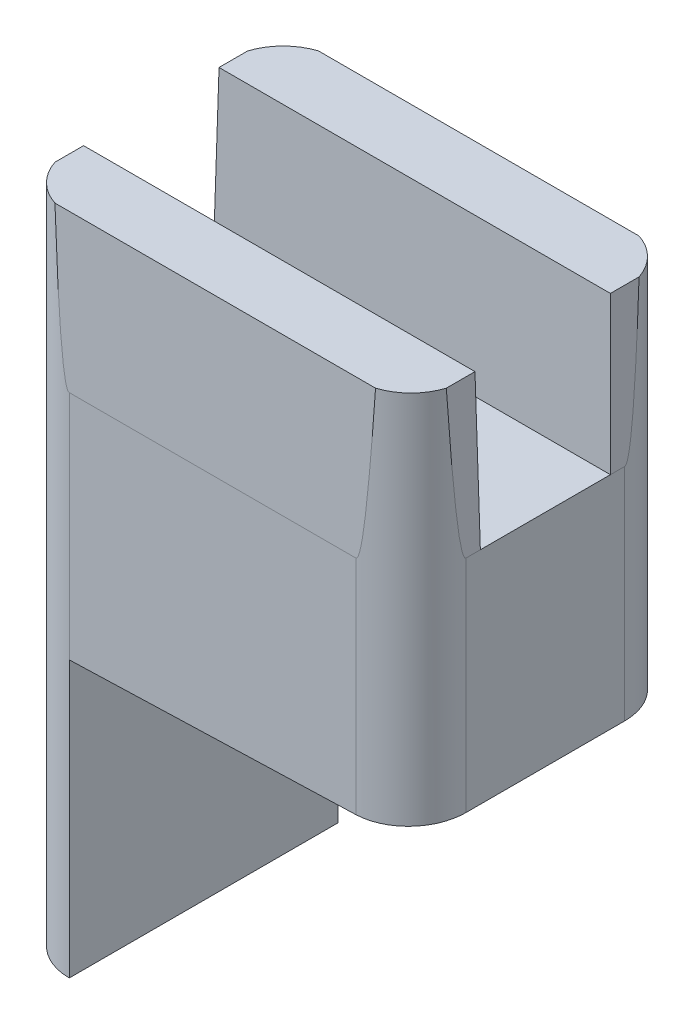
ISO-10303-21;
HEADER;
FILE_DESCRIPTION(('STEP AP214'),'2;1');
FILE_NAME('part.step','',(''),(''),'','','');
FILE_SCHEMA(('AUTOMOTIVE_DESIGN { 1 0 10303 214 1 1 1 1 }'));
ENDSEC;
DATA;
#1=APPLICATION_CONTEXT('core data for automotive mechanical design processes');
#2=APPLICATION_PROTOCOL_DEFINITION('international standard','automotive_design',2000,#1);
#3=PRODUCT_CONTEXT('',#1,'mechanical');
#4=PRODUCT('Part','Part','',(#3));
#5=PRODUCT_RELATED_PRODUCT_CATEGORY('part','',(#4));
#6=PRODUCT_DEFINITION_FORMATION('','',#4);
#7=PRODUCT_DEFINITION_CONTEXT('part definition',#1,'design');
#8=PRODUCT_DEFINITION('design','',#6,#7);
#9=PRODUCT_DEFINITION_SHAPE('','',#8);
#10=(LENGTH_UNIT() NAMED_UNIT(*) SI_UNIT(.MILLI.,.METRE.));
#11=(NAMED_UNIT(*) PLANE_ANGLE_UNIT() SI_UNIT($,.RADIAN.));
#12=(NAMED_UNIT(*) SI_UNIT($,.STERADIAN.) SOLID_ANGLE_UNIT());
#13=UNCERTAINTY_MEASURE_WITH_UNIT(LENGTH_MEASURE(1.E-05),#10,'distance_accuracy_value','');
#14=(GEOMETRIC_REPRESENTATION_CONTEXT(3) GLOBAL_UNCERTAINTY_ASSIGNED_CONTEXT((#13)) GLOBAL_UNIT_ASSIGNED_CONTEXT((#10,
#11,#12)) REPRESENTATION_CONTEXT('',''));
#15=CARTESIAN_POINT('',(0.,0.,0.));
#16=DIRECTION('',(0.,0.,1.));
#17=DIRECTION('',(1.,0.,0.));
#18=AXIS2_PLACEMENT_3D('',#15,#16,#17);
#19=CARTESIAN_POINT('',(0.,46.,24.4));
#20=DIRECTION('',(0.,-1.,0.));
#21=DIRECTION('',(0.,0.,-1.));
#22=AXIS2_PLACEMENT_3D('',#19,#20,#21);
#23=PLANE('',#22);
#24=DIRECTION('',(-1.,0.,0.));
#25=VECTOR('',#24,1.);
#26=CARTESIAN_POINT('',(0.,46.,18.1));
#27=LINE('',#26,#25);
#28=CARTESIAN_POINT('',(36.,46.,18.1));
#29=VERTEX_POINT('',#28);
#30=CARTESIAN_POINT('',(0.,46.,18.1));
#31=VERTEX_POINT('',#30);
#32=EDGE_CURVE('E178',#29,#31,#27,.T.);
#33=ORIENTED_EDGE('',*,*,#32,.F.);
#34=DIRECTION('',(0.,0.,-1.));
#35=VECTOR('',#34,1.);
#36=CARTESIAN_POINT('',(36.,46.,24.4));
#37=LINE('',#36,#35);
#38=CARTESIAN_POINT('',(36.,46.,6.3));
#39=VERTEX_POINT('',#38);
#40=EDGE_CURVE('E235',#29,#39,#37,.T.);
#41=ORIENTED_EDGE('',*,*,#40,.T.);
#42=DIRECTION('',(1.,0.,0.));
#43=VECTOR('',#42,1.);
#44=CARTESIAN_POINT('',(0.,46.,6.3));
#45=LINE('',#44,#43);
#46=CARTESIAN_POINT('',(0.,46.,6.3));
#47=VERTEX_POINT('',#46);
#48=EDGE_CURVE('E194',#47,#39,#45,.T.);
#49=ORIENTED_EDGE('',*,*,#48,.F.);
#50=DIRECTION('',(0.,0.,-1.));
#51=VECTOR('',#50,1.);
#52=CARTESIAN_POINT('',(0.,46.,24.4));
#53=LINE('',#52,#51);
#54=EDGE_CURVE('E226',#31,#47,#53,.T.);
#55=ORIENTED_EDGE('',*,*,#54,.F.);
#56=EDGE_LOOP('',(#33,#41,#49,#55));
#57=FACE_BOUND('',#56,.T.);
#58=ADVANCED_FACE('F41',(#57),#23,.F.);
#59=CARTESIAN_POINT('',(0.,0.,24.4));
#60=DIRECTION('',(1.,0.,0.));
#61=DIRECTION('',(0.,0.,-1.));
#62=AXIS2_PLACEMENT_3D('',#59,#60,#61);
#63=PLANE('',#62);
#64=DIRECTION('',(0.,0.,1.));
#65=VECTOR('',#64,1.);
#66=CARTESIAN_POINT('',(0.,46.,0.));
#67=LINE('',#66,#65);
#68=CARTESIAN_POINT('',(0.,46.,5.));
#69=VERTEX_POINT('',#68);
#70=EDGE_CURVE('E187',#69,#47,#67,.T.);
#71=ORIENTED_EDGE('',*,*,#70,.F.);
#72=DIRECTION('',(0.,-1.,0.));
#73=VECTOR('',#72,1.);
#74=CARTESIAN_POINT('',(0.,0.,5.));
#75=LINE('',#74,#73);
#76=CARTESIAN_POINT('',(0.,0.,5.));
#77=VERTEX_POINT('',#76);
#78=EDGE_CURVE('E290',#69,#77,#75,.T.);
#79=ORIENTED_EDGE('',*,*,#78,.T.);
#80=DIRECTION('',(0.,0.,-1.));
#81=VECTOR('',#80,1.);
#82=CARTESIAN_POINT('',(0.,0.,24.4));
#83=LINE('',#82,#81);
#84=CARTESIAN_POINT('',(0.,0.,19.4));
#85=VERTEX_POINT('',#84);
#86=EDGE_CURVE('E247',#85,#77,#83,.T.);
#87=ORIENTED_EDGE('',*,*,#86,.F.);
#88=DIRECTION('',(0.,-1.,0.));
#89=VECTOR('',#88,1.);
#90=CARTESIAN_POINT('',(0.,0.,19.4));
#91=LINE('',#90,#89);
#92=CARTESIAN_POINT('',(0.,46.,19.4));
#93=VERTEX_POINT('',#92);
#94=EDGE_CURVE('E63',#85,#93,#91,.F.);
#95=ORIENTED_EDGE('',*,*,#94,.T.);
#96=EDGE_CURVE('E233',#93,#31,#53,.T.);
#97=ORIENTED_EDGE('',*,*,#96,.T.);
#98=ORIENTED_EDGE('',*,*,#54,.T.);
#99=EDGE_LOOP('',(#71,#79,#87,#95,#97,#98));
#100=FACE_BOUND('',#99,.T.);
#101=ADVANCED_FACE('F344',(#100),#63,.F.);
#102=CARTESIAN_POINT('',(0.,0.,24.4));
#103=DIRECTION('',(0.,1.,0.));
#104=DIRECTION('',(0.,0.,1.));
#105=AXIS2_PLACEMENT_3D('',#102,#103,#104);
#106=PLANE('',#105);
#107=ORIENTED_EDGE('',*,*,#86,.T.);
#108=CARTESIAN_POINT('',(5.,0.,5.));
#109=DIRECTION('',(0.,1.,0.));
#110=DIRECTION('',(0.,0.,1.));
#111=AXIS2_PLACEMENT_3D('',#108,#109,#110);
#112=CIRCLE('',#111,5.);
#113=CARTESIAN_POINT('',(5.,0.,0.));
#114=VERTEX_POINT('',#113);
#115=EDGE_CURVE('E295',#77,#114,#112,.F.);
#116=ORIENTED_EDGE('',*,*,#115,.T.);
#117=DIRECTION('',(0.,0.,-1.));
#118=VECTOR('',#117,1.);
#119=CARTESIAN_POINT('',(5.,0.,24.4));
#120=LINE('',#119,#118);
#121=CARTESIAN_POINT('',(5.,0.,24.4));
#122=VERTEX_POINT('',#121);
#123=EDGE_CURVE('E244',#122,#114,#120,.T.);
#124=ORIENTED_EDGE('',*,*,#123,.F.);
#125=CARTESIAN_POINT('',(5.,0.,19.4));
#126=DIRECTION('',(0.,1.,0.));
#127=DIRECTION('',(0.,0.,1.));
#128=AXIS2_PLACEMENT_3D('',#125,#126,#127);
#129=CIRCLE('',#128,5.);
#130=EDGE_CURVE('E293',#122,#85,#129,.F.);
#131=ORIENTED_EDGE('',*,*,#130,.T.);
#132=EDGE_LOOP('',(#107,#116,#124,#131));
#133=FACE_BOUND('',#132,.T.);
#134=ADVANCED_FACE('F297',(#133),#106,.F.);
#135=CARTESIAN_POINT('',(5.,0.,24.4));
#136=DIRECTION('',(-1.,0.,0.));
#137=DIRECTION('',(0.,0.,1.));
#138=AXIS2_PLACEMENT_3D('',#135,#136,#137);
#139=PLANE('',#138);
#140=DIRECTION('',(0.,1.,0.));
#141=VECTOR('',#140,1.);
#142=CARTESIAN_POINT('',(5.,0.,0.));
#143=LINE('',#142,#141);
#144=CARTESIAN_POINT('',(5.,25.,0.));
#145=VERTEX_POINT('',#144);
#146=EDGE_CURVE('E204',#114,#145,#143,.T.);
#147=ORIENTED_EDGE('',*,*,#146,.T.);
#148=DIRECTION('',(0.,0.,-1.));
#149=VECTOR('',#148,1.);
#150=CARTESIAN_POINT('',(5.,25.,24.4));
#151=LINE('',#150,#149);
#152=CARTESIAN_POINT('',(5.,25.,24.4));
#153=VERTEX_POINT('',#152);
#154=EDGE_CURVE('E241',#153,#145,#151,.T.);
#155=ORIENTED_EDGE('',*,*,#154,.F.);
#156=DIRECTION('',(0.,1.,0.));
#157=VECTOR('',#156,1.);
#158=CARTESIAN_POINT('',(5.,0.,24.4));
#159=LINE('',#158,#157);
#160=EDGE_CURVE('E217',#122,#153,#159,.T.);
#161=ORIENTED_EDGE('',*,*,#160,.F.);
#162=ORIENTED_EDGE('',*,*,#123,.T.);
#163=EDGE_LOOP('',(#147,#155,#161,#162));
#164=FACE_BOUND('',#163,.T.);
#165=ADVANCED_FACE('F303',(#164),#139,.F.);
#166=CARTESIAN_POINT('',(5.,25.,24.4));
#167=DIRECTION('',(-0.0322412940109581,0.9994801143397,0.));
#168=DIRECTION('',(-0.9994801143397,-0.0322412940109581,0.));
#169=AXIS2_PLACEMENT_3D('',#166,#167,#168);
#170=PLANE('',#169);
#171=DIRECTION('',(0.,0.,-1.));
#172=VECTOR('',#171,1.);
#173=CARTESIAN_POINT('',(36.,26.,24.4));
#174=LINE('',#173,#172);
#175=CARTESIAN_POINT('',(36.,26.,19.4));
#176=VERTEX_POINT('',#175);
#177=CARTESIAN_POINT('',(36.,26.,5.));
#178=VERTEX_POINT('',#177);
#179=EDGE_CURVE('E238',#176,#178,#174,.T.);
#180=ORIENTED_EDGE('',*,*,#179,.F.);
#181=CARTESIAN_POINT('',(31.,25.8387096774194,19.4));
#182=DIRECTION('',(-0.0322412940109581,0.9994801143397,0.));
#183=DIRECTION('',(0.9994801143397,0.0322412940109581,0.));
#184=AXIS2_PLACEMENT_3D('',#181,#182,#183);
#185=ELLIPSE('',#184,5.00260078040994,5.);
#186=CARTESIAN_POINT('',(31.,25.8387096774194,24.4));
#187=VERTEX_POINT('',#186);
#188=EDGE_CURVE('E273',#176,#187,#185,.F.);
#189=ORIENTED_EDGE('',*,*,#188,.T.);
#190=DIRECTION('',(0.9994801143397,0.0322412940109581,0.));
#191=VECTOR('',#190,1.);
#192=CARTESIAN_POINT('',(5.,25.,24.4));
#193=LINE('',#192,#191);
#194=EDGE_CURVE('E219',#153,#187,#193,.T.);
#195=ORIENTED_EDGE('',*,*,#194,.F.);
#196=ORIENTED_EDGE('',*,*,#154,.T.);
#197=DIRECTION('',(0.9994801143397,0.0322412940109581,0.));
#198=VECTOR('',#197,1.);
#199=CARTESIAN_POINT('',(5.,25.,0.));
#200=LINE('',#199,#198);
#201=CARTESIAN_POINT('',(31.,25.8387096774194,0.));
#202=VERTEX_POINT('',#201);
#203=EDGE_CURVE('E228',#145,#202,#200,.T.);
#204=ORIENTED_EDGE('',*,*,#203,.T.);
#205=CARTESIAN_POINT('',(31.,25.8387096774194,5.));
#206=DIRECTION('',(-0.0322412940109581,0.9994801143397,0.));
#207=DIRECTION('',(-0.9994801143397,-0.0322412940109581,0.));
#208=AXIS2_PLACEMENT_3D('',#205,#206,#207);
#209=ELLIPSE('',#208,5.00260078040994,5.);
#210=EDGE_CURVE('E271',#202,#178,#209,.F.);
#211=ORIENTED_EDGE('',*,*,#210,.T.);
#212=EDGE_LOOP('',(#180,#189,#195,#196,#204,#211));
#213=FACE_BOUND('',#212,.T.);
#214=ADVANCED_FACE('F326',(#213),#170,.F.);
#215=CARTESIAN_POINT('',(36.,26.,24.4));
#216=DIRECTION('',(-1.,0.,0.));
#217=DIRECTION('',(0.,0.,1.));
#218=AXIS2_PLACEMENT_3D('',#215,#216,#217);
#219=PLANE('',#218);
#220=CARTESIAN_POINT('',(36.,46.,19.4));
#221=VERTEX_POINT('',#220);
#222=EDGE_CURVE('E236',#221,#29,#37,.T.);
#223=ORIENTED_EDGE('',*,*,#222,.F.);
#224=DIRECTION('',(0.,1.,0.));
#225=VECTOR('',#224,1.);
#226=CARTESIAN_POINT('',(36.,26.,19.4));
#227=LINE('',#226,#225);
#228=EDGE_CURVE('E269',#221,#176,#227,.F.);
#229=ORIENTED_EDGE('',*,*,#228,.T.);
#230=ORIENTED_EDGE('',*,*,#179,.T.);
#231=DIRECTION('',(0.,1.,0.));
#232=VECTOR('',#231,1.);
#233=CARTESIAN_POINT('',(36.,46.,5.));
#234=LINE('',#233,#232);
#235=CARTESIAN_POINT('',(36.,46.,5.));
#236=VERTEX_POINT('',#235);
#237=EDGE_CURVE('E266',#178,#236,#234,.T.);
#238=ORIENTED_EDGE('',*,*,#237,.T.);
#239=DIRECTION('',(0.,0.,-1.));
#240=VECTOR('',#239,1.);
#241=CARTESIAN_POINT('',(36.,46.,0.));
#242=LINE('',#241,#240);
#243=EDGE_CURVE('E197',#39,#236,#242,.T.);
#244=ORIENTED_EDGE('',*,*,#243,.F.);
#245=ORIENTED_EDGE('',*,*,#40,.F.);
#246=EDGE_LOOP('',(#223,#229,#230,#238,#244,#245));
#247=FACE_BOUND('',#246,.T.);
#248=ADVANCED_FACE('F361',(#247),#219,.F.);
#249=CARTESIAN_POINT('',(0.,0.,24.4));
#250=DIRECTION('',(0.,0.,-1.));
#251=DIRECTION('',(-1.,0.,0.));
#252=AXIS2_PLACEMENT_3D('',#249,#250,#251);
#253=PLANE('',#252);
#254=ORIENTED_EDGE('',*,*,#194,.T.);
#255=DIRECTION('',(0.,1.,0.));
#256=VECTOR('',#255,1.);
#257=CARTESIAN_POINT('',(31.,0.,24.4));
#258=LINE('',#257,#256);
#259=CARTESIAN_POINT('',(31.,46.,24.4));
#260=VERTEX_POINT('',#259);
#261=EDGE_CURVE('E253',#187,#260,#258,.T.);
#262=ORIENTED_EDGE('',*,*,#261,.T.);
#263=DIRECTION('',(-1.,0.,0.));
#264=VECTOR('',#263,1.);
#265=CARTESIAN_POINT('',(0.,46.,24.4));
#266=LINE('',#265,#264);
#267=CARTESIAN_POINT('',(5.,46.,24.4));
#268=VERTEX_POINT('',#267);
#269=EDGE_CURVE('E223',#260,#268,#266,.T.);
#270=ORIENTED_EDGE('',*,*,#269,.T.);
#271=DIRECTION('',(0.,-1.,0.));
#272=VECTOR('',#271,1.);
#273=CARTESIAN_POINT('',(5.,0.,24.4));
#274=LINE('',#273,#272);
#275=EDGE_CURVE('E250',#268,#153,#274,.T.);
#276=ORIENTED_EDGE('',*,*,#275,.T.);
#277=EDGE_LOOP('',(#254,#262,#270,#276));
#278=FACE_BOUND('',#277,.T.);
#279=ADVANCED_FACE('F331',(#278),#253,.F.);
#280=CARTESIAN_POINT('',(0.,0.,0.));
#281=DIRECTION('',(0.,0.,-1.));
#282=DIRECTION('',(-1.,0.,0.));
#283=AXIS2_PLACEMENT_3D('',#280,#281,#282);
#284=PLANE('',#283);
#285=DIRECTION('',(-1.,0.,0.));
#286=VECTOR('',#285,1.);
#287=CARTESIAN_POINT('',(0.,46.,0.));
#288=LINE('',#287,#286);
#289=CARTESIAN_POINT('',(31.,46.,0.));
#290=VERTEX_POINT('',#289);
#291=CARTESIAN_POINT('',(5.,46.,0.));
#292=VERTEX_POINT('',#291);
#293=EDGE_CURVE('E220',#290,#292,#288,.T.);
#294=ORIENTED_EDGE('',*,*,#293,.F.);
#295=DIRECTION('',(0.,1.,0.));
#296=VECTOR('',#295,1.);
#297=CARTESIAN_POINT('',(31.,26.,0.));
#298=LINE('',#297,#296);
#299=EDGE_CURVE('E287',#290,#202,#298,.F.);
#300=ORIENTED_EDGE('',*,*,#299,.T.);
#301=ORIENTED_EDGE('',*,*,#203,.F.);
#302=DIRECTION('',(0.,-1.,0.));
#303=VECTOR('',#302,1.);
#304=CARTESIAN_POINT('',(5.,46.,0.));
#305=LINE('',#304,#303);
#306=EDGE_CURVE('E285',#145,#292,#305,.F.);
#307=ORIENTED_EDGE('',*,*,#306,.T.);
#308=EDGE_LOOP('',(#294,#300,#301,#307));
#309=FACE_BOUND('',#308,.T.);
#310=ADVANCED_FACE('F313',(#309),#284,.T.);
#311=CARTESIAN_POINT('',(0.,46.,0.));
#312=DIRECTION('',(-0.999847695156391,0.0174524064372835,0.));
#313=DIRECTION('',(-0.0174524064372836,-0.999847695156391,0.));
#314=AXIS2_PLACEMENT_3D('',#311,#312,#313);
#315=PLANE('',#314);
#316=DIRECTION('',(0.,0.,-1.));
#317=VECTOR('',#316,1.);
#318=CARTESIAN_POINT('',(0.244370908995047,60.,0.));
#319=LINE('',#318,#317);
#320=CARTESIAN_POINT('',(0.244370908995047,60.,3.45598188197567));
#321=VERTEX_POINT('',#320);
#322=CARTESIAN_POINT('',(0.244370908995047,60.,6.05562909100495));
#323=VERTEX_POINT('',#322);
#324=EDGE_CURVE('E200',#321,#323,#319,.F.);
#325=ORIENTED_EDGE('',*,*,#324,.F.);
#326=CARTESIAN_POINT('',(5.,332.449808153796,5.));
#327=DIRECTION('',(-0.999847695156391,0.0174524064372835,0.));
#328=DIRECTION('',(0.0174524064372836,0.999847695156391,0.));
#329=AXIS2_PLACEMENT_3D('',#326,#327,#328);
#330=ELLIPSE('',#329,286.49344249275,5.);
#331=EDGE_CURVE('E49',#321,#69,#330,.T.);
#332=ORIENTED_EDGE('',*,*,#331,.T.);
#333=ORIENTED_EDGE('',*,*,#70,.T.);
#334=DIRECTION('',(-0.0174497491606827,-0.999695459881888,0.0174497491606827));
#335=VECTOR('',#334,1.);
#336=CARTESIAN_POINT('',(0.,46.,6.3));
#337=LINE('',#336,#335);
#338=EDGE_CURVE('E201',#323,#47,#337,.T.);
#339=ORIENTED_EDGE('',*,*,#338,.F.);
#340=EDGE_LOOP('',(#325,#332,#333,#339));
#341=FACE_BOUND('',#340,.T.);
#342=ADVANCED_FACE('F350',(#341),#315,.T.);
#343=CARTESIAN_POINT('',(0.,46.,6.3));
#344=DIRECTION('',(0.,0.0174524064372835,0.999847695156391));
#345=DIRECTION('',(0.,-0.999847695156391,0.0174524064372835));
#346=AXIS2_PLACEMENT_3D('',#343,#344,#345);
#347=PLANE('',#346);
#348=ORIENTED_EDGE('',*,*,#48,.T.);
#349=DIRECTION('',(0.0174497491606827,-0.999695459881888,0.0174497491606827));
#350=VECTOR('',#349,1.);
#351=CARTESIAN_POINT('',(35.9980816894017,46.1098999405757,6.29808168940164));
#352=LINE('',#351,#350);
#353=CARTESIAN_POINT('',(35.755629091005,60.,6.05562909100495));
#354=VERTEX_POINT('',#353);
#355=EDGE_CURVE('E205',#354,#39,#352,.T.);
#356=ORIENTED_EDGE('',*,*,#355,.F.);
#357=DIRECTION('',(-1.,0.,0.));
#358=VECTOR('',#357,1.);
#359=CARTESIAN_POINT('',(0.,60.,6.05562909100495));
#360=LINE('',#359,#358);
#361=EDGE_CURVE('E210',#323,#354,#360,.F.);
#362=ORIENTED_EDGE('',*,*,#361,.F.);
#363=ORIENTED_EDGE('',*,*,#338,.T.);
#364=EDGE_LOOP('',(#348,#356,#362,#363));
#365=FACE_BOUND('',#364,.T.);
#366=ADVANCED_FACE('F352',(#365),#347,.T.);
#367=CARTESIAN_POINT('',(36.,46.,0.));
#368=DIRECTION('',(0.999847695156391,0.0174524064372835,0.));
#369=DIRECTION('',(-0.0174524064372836,0.999847695156391,0.));
#370=AXIS2_PLACEMENT_3D('',#367,#368,#369);
#371=PLANE('',#370);
#372=ORIENTED_EDGE('',*,*,#243,.T.);
#373=CARTESIAN_POINT('',(31.,332.449808153797,5.));
#374=DIRECTION('',(0.999847695156391,0.0174524064372835,0.));
#375=DIRECTION('',(0.0174524064372836,-0.999847695156391,0.));
#376=AXIS2_PLACEMENT_3D('',#373,#374,#375);
#377=ELLIPSE('',#376,286.49344249275,5.);
#378=CARTESIAN_POINT('',(35.755629091005,60.,3.45598188197567));
#379=VERTEX_POINT('',#378);
#380=EDGE_CURVE('E275',#236,#379,#377,.T.);
#381=ORIENTED_EDGE('',*,*,#380,.T.);
#382=DIRECTION('',(0.,0.,1.));
#383=VECTOR('',#382,1.);
#384=CARTESIAN_POINT('',(35.755629091005,60.,0.));
#385=LINE('',#384,#383);
#386=EDGE_CURVE('E212',#354,#379,#385,.F.);
#387=ORIENTED_EDGE('',*,*,#386,.F.);
#388=ORIENTED_EDGE('',*,*,#355,.T.);
#389=EDGE_LOOP('',(#372,#381,#387,#388));
#390=FACE_BOUND('',#389,.T.);
#391=ADVANCED_FACE('F357',(#390),#371,.T.);
#392=CARTESIAN_POINT('',(0.,46.,0.));
#393=DIRECTION('',(0.,0.0174524064372835,-0.999847695156391));
#394=DIRECTION('',(0.,0.999847695156391,0.0174524064372835));
#395=AXIS2_PLACEMENT_3D('',#392,#393,#394);
#396=PLANE('',#395);
#397=DIRECTION('',(1.,0.,0.));
#398=VECTOR('',#397,1.);
#399=CARTESIAN_POINT('',(0.,60.,0.244370908995047));
#400=LINE('',#399,#398);
#401=CARTESIAN_POINT('',(32.5440181180243,60.,0.244370908995047));
#402=VERTEX_POINT('',#401);
#403=CARTESIAN_POINT('',(3.45598188197567,60.,0.244370908995047));
#404=VERTEX_POINT('',#403);
#405=EDGE_CURVE('E208',#402,#404,#400,.F.);
#406=ORIENTED_EDGE('',*,*,#405,.F.);
#407=CARTESIAN_POINT('',(31.,332.449808153797,5.));
#408=DIRECTION('',(0.,0.0174524064372835,-0.999847695156391));
#409=DIRECTION('',(0.,-0.999847695156391,-0.0174524064372835));
#410=AXIS2_PLACEMENT_3D('',#407,#408,#409);
#411=ELLIPSE('',#410,286.49344249275,5.);
#412=EDGE_CURVE('E283',#402,#290,#411,.T.);
#413=ORIENTED_EDGE('',*,*,#412,.T.);
#414=ORIENTED_EDGE('',*,*,#293,.T.);
#415=CARTESIAN_POINT('',(5.,332.449808153797,5.));
#416=DIRECTION('',(0.,0.0174524064372835,-0.999847695156391));
#417=DIRECTION('',(0.,0.999847695156391,0.0174524064372835));
#418=AXIS2_PLACEMENT_3D('',#415,#416,#417);
#419=ELLIPSE('',#418,286.49344249275,5.);
#420=EDGE_CURVE('E281',#292,#404,#419,.T.);
#421=ORIENTED_EDGE('',*,*,#420,.T.);
#422=EDGE_LOOP('',(#406,#413,#414,#421));
#423=FACE_BOUND('',#422,.T.);
#424=ADVANCED_FACE('F317',(#423),#396,.T.);
#425=CARTESIAN_POINT('',(0.,60.,0.));
#426=DIRECTION('',(0.,1.,0.));
#427=DIRECTION('',(0.,0.,1.));
#428=AXIS2_PLACEMENT_3D('',#425,#426,#427);
#429=PLANE('',#428);
#430=ORIENTED_EDGE('',*,*,#386,.T.);
#431=CARTESIAN_POINT('',(31.,60.,5.));
#432=DIRECTION('',(0.,1.,0.));
#433=DIRECTION('',(0.,0.,1.));
#434=AXIS2_PLACEMENT_3D('',#431,#432,#433);
#435=CIRCLE('',#434,5.);
#436=EDGE_CURVE('E279',#379,#402,#435,.T.);
#437=ORIENTED_EDGE('',*,*,#436,.T.);
#438=ORIENTED_EDGE('',*,*,#405,.T.);
#439=CARTESIAN_POINT('',(5.,60.,5.));
#440=DIRECTION('',(0.,1.,0.));
#441=DIRECTION('',(0.,0.,1.));
#442=AXIS2_PLACEMENT_3D('',#439,#440,#441);
#443=CIRCLE('',#442,5.);
#444=EDGE_CURVE('E277',#404,#321,#443,.T.);
#445=ORIENTED_EDGE('',*,*,#444,.T.);
#446=ORIENTED_EDGE('',*,*,#324,.T.);
#447=ORIENTED_EDGE('',*,*,#361,.T.);
#448=EDGE_LOOP('',(#430,#437,#438,#445,#446,#447));
#449=FACE_BOUND('',#448,.T.);
#450=ADVANCED_FACE('F347',(#449),#429,.T.);
#451=CARTESIAN_POINT('',(0.,46.,24.4));
#452=DIRECTION('',(-0.999847695156391,0.0174524064372835,0.));
#453=DIRECTION('',(-0.0174524064372835,-0.999847695156391,0.));
#454=AXIS2_PLACEMENT_3D('',#451,#452,#453);
#455=PLANE('',#454);
#456=ORIENTED_EDGE('',*,*,#96,.F.);
#457=CARTESIAN_POINT('',(5.,332.449808153797,19.4));
#458=DIRECTION('',(-0.999847695156391,0.0174524064372835,0.));
#459=DIRECTION('',(-0.0174524064372835,-0.999847695156391,0.));
#460=AXIS2_PLACEMENT_3D('',#457,#458,#459);
#461=ELLIPSE('',#460,286.49344249275,5.);
#462=CARTESIAN_POINT('',(0.244370908995047,60.,20.9440181180243));
#463=VERTEX_POINT('',#462);
#464=EDGE_CURVE('E11',#93,#463,#461,.T.);
#465=ORIENTED_EDGE('',*,*,#464,.T.);
#466=DIRECTION('',(0.,0.,-1.));
#467=VECTOR('',#466,1.);
#468=CARTESIAN_POINT('',(0.244370908995047,60.,0.));
#469=LINE('',#468,#467);
#470=CARTESIAN_POINT('',(0.244370908995047,60.,18.344370908995));
#471=VERTEX_POINT('',#470);
#472=EDGE_CURVE('E165',#471,#463,#469,.F.);
#473=ORIENTED_EDGE('',*,*,#472,.F.);
#474=DIRECTION('',(-0.0174497491606827,-0.999695459881887,-0.0174497491606827));
#475=VECTOR('',#474,1.);
#476=CARTESIAN_POINT('',(0.00191831059835571,46.1098999405757,18.1019183105984));
#477=LINE('',#476,#475);
#478=EDGE_CURVE('E172',#471,#31,#477,.T.);
#479=ORIENTED_EDGE('',*,*,#478,.T.);
#480=EDGE_LOOP('',(#456,#465,#473,#479));
#481=FACE_BOUND('',#480,.T.);
#482=ADVANCED_FACE('F183',(#481),#455,.T.);
#483=CARTESIAN_POINT('',(0.,46.,24.4));
#484=DIRECTION('',(0.,0.0174524064372835,0.999847695156391));
#485=DIRECTION('',(0.,-0.999847695156391,0.0174524064372835));
#486=AXIS2_PLACEMENT_3D('',#483,#484,#485);
#487=PLANE('',#486);
#488=ORIENTED_EDGE('',*,*,#269,.F.);
#489=CARTESIAN_POINT('',(31.,332.449808153797,19.4));
#490=DIRECTION('',(0.,0.0174524064372835,0.999847695156391));
#491=DIRECTION('',(0.,0.999847695156391,-0.0174524064372835));
#492=AXIS2_PLACEMENT_3D('',#489,#490,#491);
#493=ELLIPSE('',#492,286.49344249275,5.);
#494=CARTESIAN_POINT('',(32.5440181180243,60.,24.155629091005));
#495=VERTEX_POINT('',#494);
#496=EDGE_CURVE('E258',#260,#495,#493,.T.);
#497=ORIENTED_EDGE('',*,*,#496,.T.);
#498=DIRECTION('',(-1.,0.,0.));
#499=VECTOR('',#498,1.);
#500=CARTESIAN_POINT('',(0.,60.,24.155629091005));
#501=LINE('',#500,#499);
#502=CARTESIAN_POINT('',(3.45598188197567,60.,24.155629091005));
#503=VERTEX_POINT('',#502);
#504=EDGE_CURVE('E185',#503,#495,#501,.F.);
#505=ORIENTED_EDGE('',*,*,#504,.F.);
#506=CARTESIAN_POINT('',(5.,332.449808153797,19.4));
#507=DIRECTION('',(0.,0.0174524064372835,0.999847695156391));
#508=DIRECTION('',(0.,-0.999847695156391,0.0174524064372835));
#509=AXIS2_PLACEMENT_3D('',#506,#507,#508);
#510=ELLIPSE('',#509,286.49344249275,5.);
#511=EDGE_CURVE('E256',#503,#268,#510,.T.);
#512=ORIENTED_EDGE('',*,*,#511,.T.);
#513=EDGE_LOOP('',(#488,#497,#505,#512));
#514=FACE_BOUND('',#513,.T.);
#515=ADVANCED_FACE('F341',(#514),#487,.T.);
#516=CARTESIAN_POINT('',(36.,46.,24.4));
#517=DIRECTION('',(0.999847695156391,0.0174524064372835,0.));
#518=DIRECTION('',(-0.0174524064372835,0.999847695156391,0.));
#519=AXIS2_PLACEMENT_3D('',#516,#517,#518);
#520=PLANE('',#519);
#521=DIRECTION('',(0.,0.,1.));
#522=VECTOR('',#521,1.);
#523=CARTESIAN_POINT('',(35.755629091005,60.,0.));
#524=LINE('',#523,#522);
#525=CARTESIAN_POINT('',(35.755629091005,60.,20.9440181180243));
#526=VERTEX_POINT('',#525);
#527=CARTESIAN_POINT('',(35.755629091005,60.,18.344370908995));
#528=VERTEX_POINT('',#527);
#529=EDGE_CURVE('E168',#526,#528,#524,.F.);
#530=ORIENTED_EDGE('',*,*,#529,.F.);
#531=CARTESIAN_POINT('',(31.,332.449808153797,19.4));
#532=DIRECTION('',(0.999847695156391,0.0174524064372835,0.));
#533=DIRECTION('',(-0.0174524064372835,0.999847695156391,0.));
#534=AXIS2_PLACEMENT_3D('',#531,#532,#533);
#535=ELLIPSE('',#534,286.49344249275,5.);
#536=EDGE_CURVE('E264',#526,#221,#535,.T.);
#537=ORIENTED_EDGE('',*,*,#536,.T.);
#538=ORIENTED_EDGE('',*,*,#222,.T.);
#539=DIRECTION('',(0.0174497491606827,-0.999695459881887,-0.0174497491606827));
#540=VECTOR('',#539,1.);
#541=CARTESIAN_POINT('',(35.9890382251523,46.6279996604324,18.1109617748477));
#542=LINE('',#541,#540);
#543=EDGE_CURVE('E181',#528,#29,#542,.T.);
#544=ORIENTED_EDGE('',*,*,#543,.F.);
#545=EDGE_LOOP('',(#530,#537,#538,#544));
#546=FACE_BOUND('',#545,.T.);
#547=ADVANCED_FACE('F364',(#546),#520,.T.);
#548=CARTESIAN_POINT('',(0.,46.,18.1));
#549=DIRECTION('',(0.,0.0174524064372835,-0.999847695156391));
#550=DIRECTION('',(0.,0.999847695156391,0.0174524064372835));
#551=AXIS2_PLACEMENT_3D('',#548,#549,#550);
#552=PLANE('',#551);
#553=ORIENTED_EDGE('',*,*,#32,.T.);
#554=ORIENTED_EDGE('',*,*,#478,.F.);
#555=DIRECTION('',(1.,0.,0.));
#556=VECTOR('',#555,1.);
#557=CARTESIAN_POINT('',(0.,60.,18.344370908995));
#558=LINE('',#557,#556);
#559=EDGE_CURVE('E160',#528,#471,#558,.F.);
#560=ORIENTED_EDGE('',*,*,#559,.F.);
#561=ORIENTED_EDGE('',*,*,#543,.T.);
#562=EDGE_LOOP('',(#553,#554,#560,#561));
#563=FACE_BOUND('',#562,.T.);
#564=ADVANCED_FACE('F176',(#563),#552,.T.);
#565=CARTESIAN_POINT('',(0.,60.,0.));
#566=DIRECTION('',(0.,-1.,0.));
#567=DIRECTION('',(0.,0.,-1.));
#568=AXIS2_PLACEMENT_3D('',#565,#566,#567);
#569=PLANE('',#568);
#570=ORIENTED_EDGE('',*,*,#504,.T.);
#571=CARTESIAN_POINT('',(31.,60.,19.4));
#572=DIRECTION('',(0.,-1.,0.));
#573=DIRECTION('',(0.,0.,-1.));
#574=AXIS2_PLACEMENT_3D('',#571,#572,#573);
#575=CIRCLE('',#574,5.);
#576=EDGE_CURVE('E262',#495,#526,#575,.F.);
#577=ORIENTED_EDGE('',*,*,#576,.T.);
#578=ORIENTED_EDGE('',*,*,#529,.T.);
#579=ORIENTED_EDGE('',*,*,#559,.T.);
#580=ORIENTED_EDGE('',*,*,#472,.T.);
#581=CARTESIAN_POINT('',(5.,60.,19.4));
#582=DIRECTION('',(0.,-1.,0.));
#583=DIRECTION('',(0.,0.,-1.));
#584=AXIS2_PLACEMENT_3D('',#581,#582,#583);
#585=CIRCLE('',#584,5.);
#586=EDGE_CURVE('E260',#463,#503,#585,.F.);
#587=ORIENTED_EDGE('',*,*,#586,.T.);
#588=EDGE_LOOP('',(#570,#577,#578,#579,#580,#587));
#589=FACE_BOUND('',#588,.T.);
#590=ADVANCED_FACE('F163',(#589),#569,.F.);
#591=CARTESIAN_POINT('',(31.,0.,19.4));
#592=DIRECTION('',(0.,1.,0.));
#593=DIRECTION('',(0.,0.,1.));
#594=AXIS2_PLACEMENT_3D('',#591,#592,#593);
#595=CYLINDRICAL_SURFACE('',#594,5.);
#596=ORIENTED_EDGE('',*,*,#188,.F.);
#597=ORIENTED_EDGE('',*,*,#228,.F.);
#598=ORIENTED_EDGE('',*,*,#536,.F.);
#599=ORIENTED_EDGE('',*,*,#576,.F.);
#600=ORIENTED_EDGE('',*,*,#496,.F.);
#601=ORIENTED_EDGE('',*,*,#261,.F.);
#602=EDGE_LOOP('',(#596,#597,#598,#599,#600,#601));
#603=FACE_BOUND('',#602,.T.);
#604=ADVANCED_FACE('F335',(#603),#595,.T.);
#605=CARTESIAN_POINT('',(31.,26.,5.));
#606=DIRECTION('',(0.,-1.,0.));
#607=DIRECTION('',(0.,0.,-1.));
#608=AXIS2_PLACEMENT_3D('',#605,#606,#607);
#609=CYLINDRICAL_SURFACE('',#608,5.);
#610=ORIENTED_EDGE('',*,*,#210,.F.);
#611=ORIENTED_EDGE('',*,*,#299,.F.);
#612=ORIENTED_EDGE('',*,*,#412,.F.);
#613=ORIENTED_EDGE('',*,*,#436,.F.);
#614=ORIENTED_EDGE('',*,*,#380,.F.);
#615=ORIENTED_EDGE('',*,*,#237,.F.);
#616=EDGE_LOOP('',(#610,#611,#612,#613,#614,#615));
#617=FACE_BOUND('',#616,.T.);
#618=ADVANCED_FACE('F322',(#617),#609,.T.);
#619=CARTESIAN_POINT('',(5.,0.,5.));
#620=DIRECTION('',(0.,1.,0.));
#621=DIRECTION('',(0.,0.,1.));
#622=AXIS2_PLACEMENT_3D('',#619,#620,#621);
#623=CYLINDRICAL_SURFACE('',#622,5.);
#624=ORIENTED_EDGE('',*,*,#306,.F.);
#625=ORIENTED_EDGE('',*,*,#146,.F.);
#626=ORIENTED_EDGE('',*,*,#115,.F.);
#627=ORIENTED_EDGE('',*,*,#78,.F.);
#628=ORIENTED_EDGE('',*,*,#331,.F.);
#629=ORIENTED_EDGE('',*,*,#444,.F.);
#630=ORIENTED_EDGE('',*,*,#420,.F.);
#631=EDGE_LOOP('',(#624,#625,#626,#627,#628,#629,#630));
#632=FACE_BOUND('',#631,.T.);
#633=ADVANCED_FACE('F307',(#632),#623,.T.);
#634=CARTESIAN_POINT('',(5.,0.,19.4));
#635=DIRECTION('',(0.,-1.,0.));
#636=DIRECTION('',(0.,0.,-1.));
#637=AXIS2_PLACEMENT_3D('',#634,#635,#636);
#638=CYLINDRICAL_SURFACE('',#637,5.);
#639=ORIENTED_EDGE('',*,*,#464,.F.);
#640=ORIENTED_EDGE('',*,*,#94,.F.);
#641=ORIENTED_EDGE('',*,*,#130,.F.);
#642=ORIENTED_EDGE('',*,*,#160,.T.);
#643=ORIENTED_EDGE('',*,*,#275,.F.);
#644=ORIENTED_EDGE('',*,*,#511,.F.);
#645=ORIENTED_EDGE('',*,*,#586,.F.);
#646=EDGE_LOOP('',(#639,#640,#641,#642,#643,#644,#645));
#647=FACE_BOUND('',#646,.T.);
#648=ADVANCED_FACE('F43',(#647),#638,.T.);
#649=CLOSED_SHELL('',(#58,#101,#134,#165,#214,#248,#279,#310,#342,#366,#391,#424,#450,#482,#515,
#547,#564,#590,#604,#618,#633,#648));
#650=MANIFOLD_SOLID_BREP('B2',#649);
#651=ADVANCED_BREP_SHAPE_REPRESENTATION('',(#18,#650),#14);
#652=SHAPE_DEFINITION_REPRESENTATION(#9,#651);
ENDSEC;
END-ISO-10303-21;
